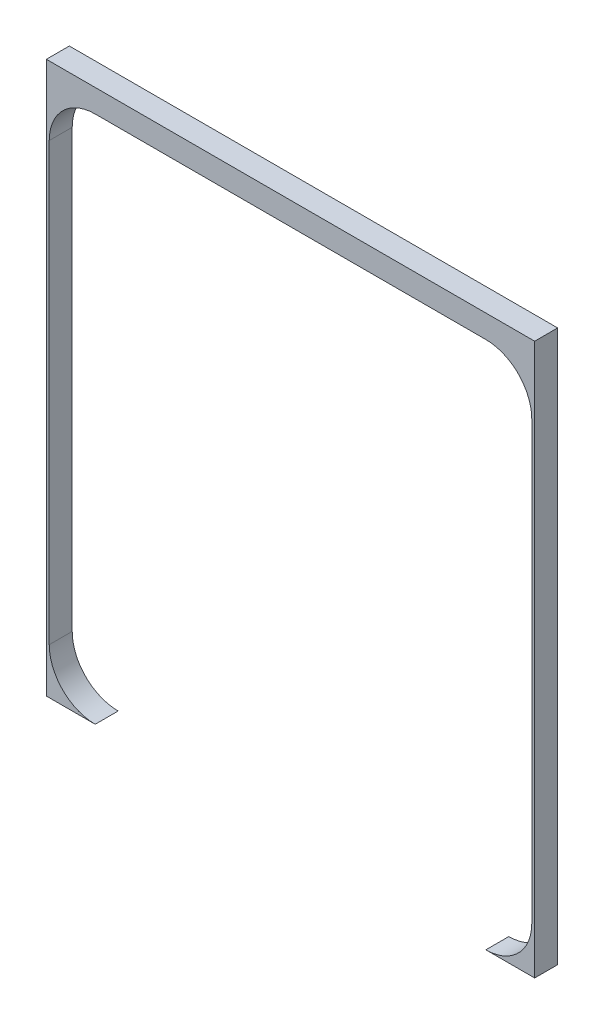
ISO-10303-21;
HEADER;
FILE_DESCRIPTION(('STEP AP214'),'2;1');
FILE_NAME('part.step','',(''),(''),'','','');
FILE_SCHEMA(('AUTOMOTIVE_DESIGN { 1 0 10303 214 1 1 1 1 }'));
ENDSEC;
DATA;
#1=APPLICATION_CONTEXT('core data for automotive mechanical design processes');
#2=APPLICATION_PROTOCOL_DEFINITION('international standard','automotive_design',2000,#1);
#3=PRODUCT_CONTEXT('',#1,'mechanical');
#4=PRODUCT('Part','Part','',(#3));
#5=PRODUCT_RELATED_PRODUCT_CATEGORY('part','',(#4));
#6=PRODUCT_DEFINITION_FORMATION('','',#4);
#7=PRODUCT_DEFINITION_CONTEXT('part definition',#1,'design');
#8=PRODUCT_DEFINITION('design','',#6,#7);
#9=PRODUCT_DEFINITION_SHAPE('','',#8);
#10=(LENGTH_UNIT() NAMED_UNIT(*) SI_UNIT(.MILLI.,.METRE.));
#11=(NAMED_UNIT(*) PLANE_ANGLE_UNIT() SI_UNIT($,.RADIAN.));
#12=(NAMED_UNIT(*) SI_UNIT($,.STERADIAN.) SOLID_ANGLE_UNIT());
#13=UNCERTAINTY_MEASURE_WITH_UNIT(LENGTH_MEASURE(1.E-05),#10,'distance_accuracy_value','');
#14=(GEOMETRIC_REPRESENTATION_CONTEXT(3) GLOBAL_UNCERTAINTY_ASSIGNED_CONTEXT((#13)) GLOBAL_UNIT_ASSIGNED_CONTEXT((#10,
#11,#12)) REPRESENTATION_CONTEXT('',''));
#15=CARTESIAN_POINT('',(0.,0.,0.));
#16=DIRECTION('',(0.,0.,1.));
#17=DIRECTION('',(1.,0.,0.));
#18=AXIS2_PLACEMENT_3D('',#15,#16,#17);
#19=CARTESIAN_POINT('',(-269.875,-304.8,25.4));
#20=DIRECTION('',(0.,1.,0.));
#21=DIRECTION('',(0.,0.,1.));
#22=AXIS2_PLACEMENT_3D('',#19,#20,#21);
#23=PLANE('',#22);
#24=DIRECTION('',(0.,0.,-1.));
#25=VECTOR('',#24,1.);
#26=CARTESIAN_POINT('',(-215.90000000001,-304.799999999998,25.4));
#27=LINE('',#26,#25);
#28=CARTESIAN_POINT('',(-215.90000000001,-304.799999999998,25.4));
#29=VERTEX_POINT('',#28);
#30=CARTESIAN_POINT('',(-215.90000000001,-304.8,0.));
#31=VERTEX_POINT('',#30);
#32=EDGE_CURVE('E54',#29,#31,#27,.T.);
#33=ORIENTED_EDGE('',*,*,#32,.F.);
#34=DIRECTION('',(1.,0.,0.));
#35=VECTOR('',#34,1.);
#36=CARTESIAN_POINT('',(-269.875,-304.8,25.4));
#37=LINE('',#36,#35);
#38=CARTESIAN_POINT('',(-269.875,-304.8,25.4));
#39=VERTEX_POINT('',#38);
#40=EDGE_CURVE('E155',#39,#29,#37,.T.);
#41=ORIENTED_EDGE('',*,*,#40,.F.);
#42=DIRECTION('',(0.,0.,-1.));
#43=VECTOR('',#42,1.);
#44=CARTESIAN_POINT('',(-269.875,-304.8,25.4));
#45=LINE('',#44,#43);
#46=CARTESIAN_POINT('',(-269.875,-304.8,0.));
#47=VERTEX_POINT('',#46);
#48=EDGE_CURVE('E175',#39,#47,#45,.T.);
#49=ORIENTED_EDGE('',*,*,#48,.T.);
#50=DIRECTION('',(1.,0.,0.));
#51=VECTOR('',#50,1.);
#52=CARTESIAN_POINT('',(-269.875,-304.8,0.));
#53=LINE('',#52,#51);
#54=EDGE_CURVE('E170',#47,#31,#53,.T.);
#55=ORIENTED_EDGE('',*,*,#54,.T.);
#56=EDGE_LOOP('',(#33,#41,#49,#55));
#57=FACE_BOUND('',#56,.T.);
#58=ADVANCED_FACE('F39',(#57),#23,.F.);
#59=CARTESIAN_POINT('',(269.875,-304.8,25.4));
#60=DIRECTION('',(-1.,0.,0.));
#61=DIRECTION('',(0.,0.,1.));
#62=AXIS2_PLACEMENT_3D('',#59,#60,#61);
#63=PLANE('',#62);
#64=DIRECTION('',(0.,1.,0.));
#65=VECTOR('',#64,1.);
#66=CARTESIAN_POINT('',(269.875,-304.8,0.));
#67=LINE('',#66,#65);
#68=CARTESIAN_POINT('',(269.875,-304.8,0.));
#69=VERTEX_POINT('',#68);
#70=CARTESIAN_POINT('',(269.875,304.8,0.));
#71=VERTEX_POINT('',#70);
#72=EDGE_CURVE('E162',#69,#71,#67,.T.);
#73=ORIENTED_EDGE('',*,*,#72,.T.);
#74=DIRECTION('',(0.,0.,-1.));
#75=VECTOR('',#74,1.);
#76=CARTESIAN_POINT('',(269.875,304.8,25.4));
#77=LINE('',#76,#75);
#78=CARTESIAN_POINT('',(269.875,304.8,25.4));
#79=VERTEX_POINT('',#78);
#80=EDGE_CURVE('E11',#79,#71,#77,.T.);
#81=ORIENTED_EDGE('',*,*,#80,.F.);
#82=DIRECTION('',(0.,1.,0.));
#83=VECTOR('',#82,1.);
#84=CARTESIAN_POINT('',(269.875,-304.8,25.4));
#85=LINE('',#84,#83);
#86=CARTESIAN_POINT('',(269.875,-304.8,25.4));
#87=VERTEX_POINT('',#86);
#88=EDGE_CURVE('E173',#87,#79,#85,.T.);
#89=ORIENTED_EDGE('',*,*,#88,.F.);
#90=DIRECTION('',(0.,0.,-1.));
#91=VECTOR('',#90,1.);
#92=CARTESIAN_POINT('',(269.875,-304.8,25.4));
#93=LINE('',#92,#91);
#94=EDGE_CURVE('E153',#87,#69,#93,.T.);
#95=ORIENTED_EDGE('',*,*,#94,.T.);
#96=EDGE_LOOP('',(#73,#81,#89,#95));
#97=FACE_BOUND('',#96,.T.);
#98=ADVANCED_FACE('F41',(#97),#63,.F.);
#99=CARTESIAN_POINT('',(-269.875,304.8,25.4));
#100=DIRECTION('',(0.,-1.,0.));
#101=DIRECTION('',(0.,0.,-1.));
#102=AXIS2_PLACEMENT_3D('',#99,#100,#101);
#103=PLANE('',#102);
#104=DIRECTION('',(-1.,0.,0.));
#105=VECTOR('',#104,1.);
#106=CARTESIAN_POINT('',(-269.875,304.8,0.));
#107=LINE('',#106,#105);
#108=CARTESIAN_POINT('',(-269.875,304.8,0.));
#109=VERTEX_POINT('',#108);
#110=EDGE_CURVE('E165',#71,#109,#107,.T.);
#111=ORIENTED_EDGE('',*,*,#110,.T.);
#112=DIRECTION('',(0.,0.,-1.));
#113=VECTOR('',#112,1.);
#114=CARTESIAN_POINT('',(-269.875,304.8,25.4));
#115=LINE('',#114,#113);
#116=CARTESIAN_POINT('',(-269.875,304.8,25.4));
#117=VERTEX_POINT('',#116);
#118=EDGE_CURVE('E47',#117,#109,#115,.T.);
#119=ORIENTED_EDGE('',*,*,#118,.F.);
#120=DIRECTION('',(-1.,0.,0.));
#121=VECTOR('',#120,1.);
#122=CARTESIAN_POINT('',(-269.875,304.8,25.4));
#123=LINE('',#122,#121);
#124=EDGE_CURVE('E92',#79,#117,#123,.T.);
#125=ORIENTED_EDGE('',*,*,#124,.F.);
#126=ORIENTED_EDGE('',*,*,#80,.T.);
#127=EDGE_LOOP('',(#111,#119,#125,#126));
#128=FACE_BOUND('',#127,.T.);
#129=ADVANCED_FACE('F254',(#128),#103,.F.);
#130=CARTESIAN_POINT('',(-269.875,-304.8,25.4));
#131=DIRECTION('',(1.,0.,0.));
#132=DIRECTION('',(0.,0.,-1.));
#133=AXIS2_PLACEMENT_3D('',#130,#131,#132);
#134=PLANE('',#133);
#135=DIRECTION('',(0.,-1.,0.));
#136=VECTOR('',#135,1.);
#137=CARTESIAN_POINT('',(-269.875,-304.8,0.));
#138=LINE('',#137,#136);
#139=EDGE_CURVE('E168',#109,#47,#138,.T.);
#140=ORIENTED_EDGE('',*,*,#139,.T.);
#141=ORIENTED_EDGE('',*,*,#48,.F.);
#142=DIRECTION('',(0.,-1.,0.));
#143=VECTOR('',#142,1.);
#144=CARTESIAN_POINT('',(-269.875,-304.8,25.4));
#145=LINE('',#144,#143);
#146=EDGE_CURVE('E156',#117,#39,#145,.T.);
#147=ORIENTED_EDGE('',*,*,#146,.F.);
#148=ORIENTED_EDGE('',*,*,#118,.T.);
#149=EDGE_LOOP('',(#140,#141,#147,#148));
#150=FACE_BOUND('',#149,.T.);
#151=ADVANCED_FACE('F181',(#150),#134,.F.);
#152=CARTESIAN_POINT('',(215.89999999999,-304.799999999998,25.4));
#153=VERTEX_POINT('',#152);
#154=EDGE_CURVE('E63',#153,#87,#37,.T.);
#155=ORIENTED_EDGE('',*,*,#154,.F.);
#156=DIRECTION('',(0.,0.,-1.));
#157=VECTOR('',#156,1.);
#158=CARTESIAN_POINT('',(215.89999999999,-304.799999999998,25.4));
#159=LINE('',#158,#157);
#160=CARTESIAN_POINT('',(215.89999999999,-304.799999999998,0.));
#161=VERTEX_POINT('',#160);
#162=EDGE_CURVE('E138',#153,#161,#159,.T.);
#163=ORIENTED_EDGE('',*,*,#162,.T.);
#164=EDGE_CURVE('E85',#161,#69,#53,.T.);
#165=ORIENTED_EDGE('',*,*,#164,.T.);
#166=ORIENTED_EDGE('',*,*,#94,.F.);
#167=EDGE_LOOP('',(#155,#163,#165,#166));
#168=FACE_BOUND('',#167,.T.);
#169=ADVANCED_FACE('F152',(#168),#23,.F.);
#170=CARTESIAN_POINT('',(0.,0.,25.4));
#171=DIRECTION('',(0.,0.,-1.));
#172=DIRECTION('',(-1.,0.,0.));
#173=AXIS2_PLACEMENT_3D('',#170,#171,#172);
#174=PLANE('',#173);
#175=DIRECTION('',(0.,-1.,0.));
#176=VECTOR('',#175,1.);
#177=CARTESIAN_POINT('',(266.69999999999,-253.999999999998,25.4));
#178=LINE('',#177,#176);
#179=CARTESIAN_POINT('',(266.69999999999,228.600000000002,25.4));
#180=VERTEX_POINT('',#179);
#181=CARTESIAN_POINT('',(266.69999999999,-253.999999999998,25.4));
#182=VERTEX_POINT('',#181);
#183=EDGE_CURVE('E144',#180,#182,#178,.T.);
#184=ORIENTED_EDGE('',*,*,#183,.T.);
#185=CARTESIAN_POINT('',(215.89999999999,-253.999999999998,25.4));
#186=DIRECTION('',(0.,0.,-1.));
#187=DIRECTION('',(-1.,0.,0.));
#188=AXIS2_PLACEMENT_3D('',#185,#186,#187);
#189=CIRCLE('',#188,50.8);
#190=EDGE_CURVE('E140',#182,#153,#189,.T.);
#191=ORIENTED_EDGE('',*,*,#190,.T.);
#192=ORIENTED_EDGE('',*,*,#154,.T.);
#193=ORIENTED_EDGE('',*,*,#88,.T.);
#194=ORIENTED_EDGE('',*,*,#124,.T.);
#195=ORIENTED_EDGE('',*,*,#146,.T.);
#196=ORIENTED_EDGE('',*,*,#40,.T.);
#197=CARTESIAN_POINT('',(-215.90000000001,-253.999999999998,25.4));
#198=DIRECTION('',(0.,0.,-1.));
#199=DIRECTION('',(-1.,0.,0.));
#200=AXIS2_PLACEMENT_3D('',#197,#198,#199);
#201=CIRCLE('',#200,50.8);
#202=CARTESIAN_POINT('',(-266.70000000001,-253.999999999998,25.4));
#203=VERTEX_POINT('',#202);
#204=EDGE_CURVE('E149',#29,#203,#201,.T.);
#205=ORIENTED_EDGE('',*,*,#204,.T.);
#206=DIRECTION('',(0.,1.,0.));
#207=VECTOR('',#206,1.);
#208=CARTESIAN_POINT('',(-266.70000000001,228.600000000001,25.4));
#209=LINE('',#208,#207);
#210=CARTESIAN_POINT('',(-266.70000000001,228.600000000001,25.4));
#211=VERTEX_POINT('',#210);
#212=EDGE_CURVE('E233',#203,#211,#209,.T.);
#213=ORIENTED_EDGE('',*,*,#212,.T.);
#214=CARTESIAN_POINT('',(-215.90000000001,228.600000000001,25.4));
#215=DIRECTION('',(0.,0.,-1.));
#216=DIRECTION('',(-1.,0.,0.));
#217=AXIS2_PLACEMENT_3D('',#214,#215,#216);
#218=CIRCLE('',#217,50.8);
#219=CARTESIAN_POINT('',(-215.90000000001,279.400000000001,25.4));
#220=VERTEX_POINT('',#219);
#221=EDGE_CURVE('E230',#211,#220,#218,.T.);
#222=ORIENTED_EDGE('',*,*,#221,.T.);
#223=DIRECTION('',(1.,0.,0.));
#224=VECTOR('',#223,1.);
#225=CARTESIAN_POINT('',(215.89999999999,279.400000000001,25.4));
#226=LINE('',#225,#224);
#227=CARTESIAN_POINT('',(215.89999999999,279.400000000001,25.4));
#228=VERTEX_POINT('',#227);
#229=EDGE_CURVE('E227',#220,#228,#226,.T.);
#230=ORIENTED_EDGE('',*,*,#229,.T.);
#231=CARTESIAN_POINT('',(215.89999999999,228.600000000002,25.4));
#232=DIRECTION('',(0.,0.,-1.));
#233=DIRECTION('',(-1.,0.,0.));
#234=AXIS2_PLACEMENT_3D('',#231,#232,#233);
#235=CIRCLE('',#234,50.8);
#236=EDGE_CURVE('E225',#228,#180,#235,.T.);
#237=ORIENTED_EDGE('',*,*,#236,.T.);
#238=EDGE_LOOP('',(#184,#191,#192,#193,#194,#195,#196,#205,#213,#222,#230,#237));
#239=FACE_BOUND('',#238,.T.);
#240=ADVANCED_FACE('F146',(#239),#174,.F.);
#241=CARTESIAN_POINT('',(0.,0.,0.));
#242=DIRECTION('',(0.,0.,-1.));
#243=DIRECTION('',(-1.,0.,0.));
#244=AXIS2_PLACEMENT_3D('',#241,#242,#243);
#245=PLANE('',#244);
#246=CARTESIAN_POINT('',(215.89999999999,-253.999999999998,0.));
#247=DIRECTION('',(0.,0.,-1.));
#248=DIRECTION('',(-1.,0.,0.));
#249=AXIS2_PLACEMENT_3D('',#246,#247,#248);
#250=CIRCLE('',#249,50.8);
#251=CARTESIAN_POINT('',(266.69999999999,-253.999999999998,0.));
#252=VERTEX_POINT('',#251);
#253=EDGE_CURVE('E143',#252,#161,#250,.T.);
#254=ORIENTED_EDGE('',*,*,#253,.F.);
#255=DIRECTION('',(0.,-1.,0.));
#256=VECTOR('',#255,1.);
#257=CARTESIAN_POINT('',(266.69999999999,-253.999999999998,0.));
#258=LINE('',#257,#256);
#259=CARTESIAN_POINT('',(266.69999999999,228.600000000002,0.));
#260=VERTEX_POINT('',#259);
#261=EDGE_CURVE('E150',#260,#252,#258,.T.);
#262=ORIENTED_EDGE('',*,*,#261,.F.);
#263=CARTESIAN_POINT('',(215.89999999999,228.600000000002,0.));
#264=DIRECTION('',(0.,0.,-1.));
#265=DIRECTION('',(-1.,0.,0.));
#266=AXIS2_PLACEMENT_3D('',#263,#264,#265);
#267=CIRCLE('',#266,50.8);
#268=CARTESIAN_POINT('',(215.89999999999,279.400000000001,0.));
#269=VERTEX_POINT('',#268);
#270=EDGE_CURVE('E210',#269,#260,#267,.T.);
#271=ORIENTED_EDGE('',*,*,#270,.F.);
#272=DIRECTION('',(1.,0.,0.));
#273=VECTOR('',#272,1.);
#274=CARTESIAN_POINT('',(215.89999999999,279.400000000001,0.));
#275=LINE('',#274,#273);
#276=CARTESIAN_POINT('',(-215.90000000001,279.400000000001,0.));
#277=VERTEX_POINT('',#276);
#278=EDGE_CURVE('E213',#277,#269,#275,.T.);
#279=ORIENTED_EDGE('',*,*,#278,.F.);
#280=CARTESIAN_POINT('',(-215.90000000001,228.600000000001,0.));
#281=DIRECTION('',(0.,0.,-1.));
#282=DIRECTION('',(-1.,0.,0.));
#283=AXIS2_PLACEMENT_3D('',#280,#281,#282);
#284=CIRCLE('',#283,50.8);
#285=CARTESIAN_POINT('',(-266.70000000001,228.600000000001,0.));
#286=VERTEX_POINT('',#285);
#287=EDGE_CURVE('E216',#286,#277,#284,.T.);
#288=ORIENTED_EDGE('',*,*,#287,.F.);
#289=DIRECTION('',(0.,1.,0.));
#290=VECTOR('',#289,1.);
#291=CARTESIAN_POINT('',(-266.70000000001,228.600000000001,0.));
#292=LINE('',#291,#290);
#293=CARTESIAN_POINT('',(-266.70000000001,-253.999999999998,0.));
#294=VERTEX_POINT('',#293);
#295=EDGE_CURVE('E219',#294,#286,#292,.T.);
#296=ORIENTED_EDGE('',*,*,#295,.F.);
#297=CARTESIAN_POINT('',(-215.90000000001,-253.999999999998,0.));
#298=DIRECTION('',(0.,0.,-1.));
#299=DIRECTION('',(-1.,0.,0.));
#300=AXIS2_PLACEMENT_3D('',#297,#298,#299);
#301=CIRCLE('',#300,50.8);
#302=EDGE_CURVE('E188',#31,#294,#301,.T.);
#303=ORIENTED_EDGE('',*,*,#302,.F.);
#304=ORIENTED_EDGE('',*,*,#54,.F.);
#305=ORIENTED_EDGE('',*,*,#139,.F.);
#306=ORIENTED_EDGE('',*,*,#110,.F.);
#307=ORIENTED_EDGE('',*,*,#72,.F.);
#308=ORIENTED_EDGE('',*,*,#164,.F.);
#309=EDGE_LOOP('',(#254,#262,#271,#279,#288,#296,#303,#304,#305,#306,#307,#308));
#310=FACE_BOUND('',#309,.T.);
#311=ADVANCED_FACE('F185',(#310),#245,.T.);
#312=CARTESIAN_POINT('',(215.89999999999,-253.999999999998,25.4));
#313=DIRECTION('',(0.,0.,-1.));
#314=DIRECTION('',(-1.,0.,0.));
#315=AXIS2_PLACEMENT_3D('',#312,#313,#314);
#316=CYLINDRICAL_SURFACE('',#315,50.8);
#317=ORIENTED_EDGE('',*,*,#253,.T.);
#318=ORIENTED_EDGE('',*,*,#162,.F.);
#319=ORIENTED_EDGE('',*,*,#190,.F.);
#320=DIRECTION('',(0.,0.,-1.));
#321=VECTOR('',#320,1.);
#322=CARTESIAN_POINT('',(266.69999999999,-253.999999999998,25.4));
#323=LINE('',#322,#321);
#324=EDGE_CURVE('E166',#182,#252,#323,.T.);
#325=ORIENTED_EDGE('',*,*,#324,.T.);
#326=EDGE_LOOP('',(#317,#318,#319,#325));
#327=FACE_BOUND('',#326,.T.);
#328=ADVANCED_FACE('F139',(#327),#316,.F.);
#329=CARTESIAN_POINT('',(266.69999999999,-253.999999999998,25.4));
#330=DIRECTION('',(1.,0.,0.));
#331=DIRECTION('',(0.,0.,-1.));
#332=AXIS2_PLACEMENT_3D('',#329,#330,#331);
#333=PLANE('',#332);
#334=ORIENTED_EDGE('',*,*,#261,.T.);
#335=ORIENTED_EDGE('',*,*,#324,.F.);
#336=ORIENTED_EDGE('',*,*,#183,.F.);
#337=DIRECTION('',(0.,0.,-1.));
#338=VECTOR('',#337,1.);
#339=CARTESIAN_POINT('',(266.69999999999,228.600000000002,25.4));
#340=LINE('',#339,#338);
#341=EDGE_CURVE('E205',#180,#260,#340,.T.);
#342=ORIENTED_EDGE('',*,*,#341,.T.);
#343=EDGE_LOOP('',(#334,#335,#336,#342));
#344=FACE_BOUND('',#343,.T.);
#345=ADVANCED_FACE('F252',(#344),#333,.F.);
#346=CARTESIAN_POINT('',(215.89999999999,228.600000000002,25.4));
#347=DIRECTION('',(0.,0.,-1.));
#348=DIRECTION('',(-1.,0.,0.));
#349=AXIS2_PLACEMENT_3D('',#346,#347,#348);
#350=CYLINDRICAL_SURFACE('',#349,50.8);
#351=ORIENTED_EDGE('',*,*,#270,.T.);
#352=ORIENTED_EDGE('',*,*,#341,.F.);
#353=ORIENTED_EDGE('',*,*,#236,.F.);
#354=DIRECTION('',(0.,0.,-1.));
#355=VECTOR('',#354,1.);
#356=CARTESIAN_POINT('',(215.89999999999,279.400000000001,25.4));
#357=LINE('',#356,#355);
#358=EDGE_CURVE('E203',#228,#269,#357,.T.);
#359=ORIENTED_EDGE('',*,*,#358,.T.);
#360=EDGE_LOOP('',(#351,#352,#353,#359));
#361=FACE_BOUND('',#360,.T.);
#362=ADVANCED_FACE('F248',(#361),#350,.F.);
#363=CARTESIAN_POINT('',(215.89999999999,279.400000000001,25.4));
#364=DIRECTION('',(0.,1.,0.));
#365=DIRECTION('',(0.,0.,1.));
#366=AXIS2_PLACEMENT_3D('',#363,#364,#365);
#367=PLANE('',#366);
#368=ORIENTED_EDGE('',*,*,#278,.T.);
#369=ORIENTED_EDGE('',*,*,#358,.F.);
#370=ORIENTED_EDGE('',*,*,#229,.F.);
#371=DIRECTION('',(0.,0.,-1.));
#372=VECTOR('',#371,1.);
#373=CARTESIAN_POINT('',(-215.90000000001,279.400000000001,25.4));
#374=LINE('',#373,#372);
#375=EDGE_CURVE('E201',#220,#277,#374,.T.);
#376=ORIENTED_EDGE('',*,*,#375,.T.);
#377=EDGE_LOOP('',(#368,#369,#370,#376));
#378=FACE_BOUND('',#377,.T.);
#379=ADVANCED_FACE('F245',(#378),#367,.F.);
#380=CARTESIAN_POINT('',(-215.90000000001,228.600000000001,25.4));
#381=DIRECTION('',(0.,0.,-1.));
#382=DIRECTION('',(-1.,0.,0.));
#383=AXIS2_PLACEMENT_3D('',#380,#381,#382);
#384=CYLINDRICAL_SURFACE('',#383,50.8);
#385=ORIENTED_EDGE('',*,*,#287,.T.);
#386=ORIENTED_EDGE('',*,*,#375,.F.);
#387=ORIENTED_EDGE('',*,*,#221,.F.);
#388=DIRECTION('',(0.,0.,-1.));
#389=VECTOR('',#388,1.);
#390=CARTESIAN_POINT('',(-266.70000000001,228.600000000001,25.4));
#391=LINE('',#390,#389);
#392=EDGE_CURVE('E199',#211,#286,#391,.T.);
#393=ORIENTED_EDGE('',*,*,#392,.T.);
#394=EDGE_LOOP('',(#385,#386,#387,#393));
#395=FACE_BOUND('',#394,.T.);
#396=ADVANCED_FACE('F241',(#395),#384,.F.);
#397=CARTESIAN_POINT('',(-266.70000000001,228.600000000001,25.4));
#398=DIRECTION('',(-1.,0.,0.));
#399=DIRECTION('',(0.,0.,1.));
#400=AXIS2_PLACEMENT_3D('',#397,#398,#399);
#401=PLANE('',#400);
#402=ORIENTED_EDGE('',*,*,#295,.T.);
#403=ORIENTED_EDGE('',*,*,#392,.F.);
#404=ORIENTED_EDGE('',*,*,#212,.F.);
#405=DIRECTION('',(0.,0.,-1.));
#406=VECTOR('',#405,1.);
#407=CARTESIAN_POINT('',(-266.70000000001,-253.999999999998,25.4));
#408=LINE('',#407,#406);
#409=EDGE_CURVE('E197',#203,#294,#408,.T.);
#410=ORIENTED_EDGE('',*,*,#409,.T.);
#411=EDGE_LOOP('',(#402,#403,#404,#410));
#412=FACE_BOUND('',#411,.T.);
#413=ADVANCED_FACE('F238',(#412),#401,.F.);
#414=CARTESIAN_POINT('',(-215.90000000001,-253.999999999998,25.4));
#415=DIRECTION('',(0.,0.,-1.));
#416=DIRECTION('',(-1.,0.,0.));
#417=AXIS2_PLACEMENT_3D('',#414,#415,#416);
#418=CYLINDRICAL_SURFACE('',#417,50.8);
#419=ORIENTED_EDGE('',*,*,#302,.T.);
#420=ORIENTED_EDGE('',*,*,#409,.F.);
#421=ORIENTED_EDGE('',*,*,#204,.F.);
#422=ORIENTED_EDGE('',*,*,#32,.T.);
#423=EDGE_LOOP('',(#419,#420,#421,#422));
#424=FACE_BOUND('',#423,.T.);
#425=ADVANCED_FACE('F277',(#424),#418,.F.);
#426=CLOSED_SHELL('',(#58,#98,#129,#151,#169,#240,#311,#328,#345,#362,#379,#396,#413,#425));
#427=MANIFOLD_SOLID_BREP('B2',#426);
#428=ADVANCED_BREP_SHAPE_REPRESENTATION('',(#18,#427),#14);
#429=SHAPE_DEFINITION_REPRESENTATION(#9,#428);
ENDSEC;
END-ISO-10303-21;
